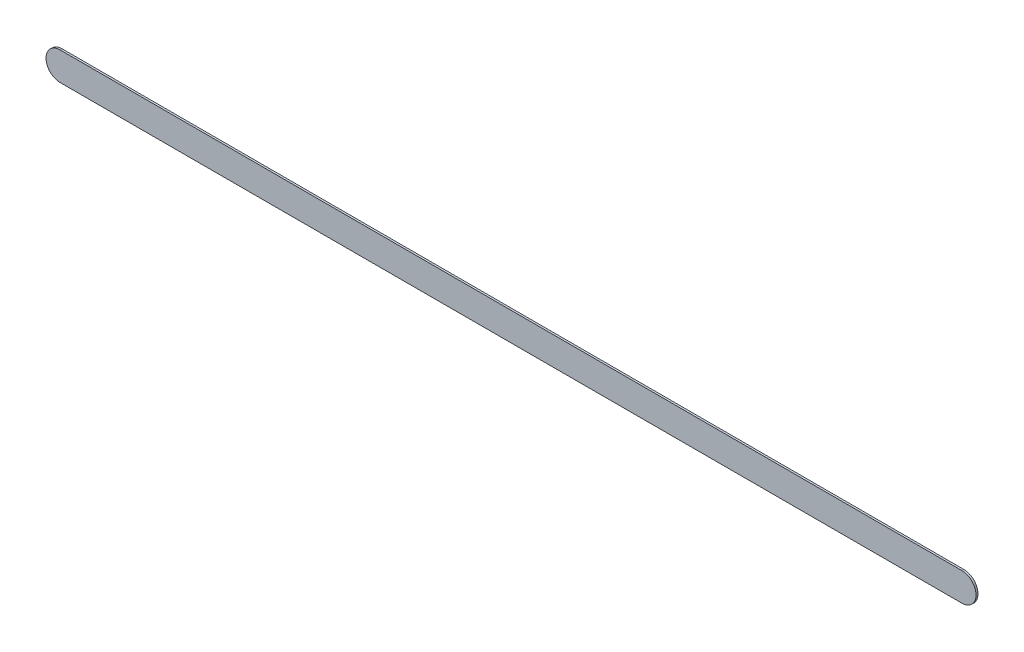
ISO-10303-21;
HEADER;
FILE_DESCRIPTION(('STEP AP214'),'2;1');
FILE_NAME('part.step','',(''),(''),'','','');
FILE_SCHEMA(('AUTOMOTIVE_DESIGN { 1 0 10303 214 1 1 1 1 }'));
ENDSEC;
DATA;
#1=APPLICATION_CONTEXT('core data for automotive mechanical design processes');
#2=APPLICATION_PROTOCOL_DEFINITION('international standard','automotive_design',2000,#1);
#3=PRODUCT_CONTEXT('',#1,'mechanical');
#4=PRODUCT('Part','Part','',(#3));
#5=PRODUCT_RELATED_PRODUCT_CATEGORY('part','',(#4));
#6=PRODUCT_DEFINITION_FORMATION('','',#4);
#7=PRODUCT_DEFINITION_CONTEXT('part definition',#1,'design');
#8=PRODUCT_DEFINITION('design','',#6,#7);
#9=PRODUCT_DEFINITION_SHAPE('','',#8);
#10=(LENGTH_UNIT() NAMED_UNIT(*) SI_UNIT(.MILLI.,.METRE.));
#11=(NAMED_UNIT(*) PLANE_ANGLE_UNIT() SI_UNIT($,.RADIAN.));
#12=(NAMED_UNIT(*) SI_UNIT($,.STERADIAN.) SOLID_ANGLE_UNIT());
#13=UNCERTAINTY_MEASURE_WITH_UNIT(LENGTH_MEASURE(1.E-05),#10,'distance_accuracy_value','');
#14=(GEOMETRIC_REPRESENTATION_CONTEXT(3) GLOBAL_UNCERTAINTY_ASSIGNED_CONTEXT((#13)) GLOBAL_UNIT_ASSIGNED_CONTEXT((#10,
#11,#12)) REPRESENTATION_CONTEXT('',''));
#15=CARTESIAN_POINT('',(0.,0.,0.));
#16=DIRECTION('',(0.,0.,1.));
#17=DIRECTION('',(1.,0.,0.));
#18=AXIS2_PLACEMENT_3D('',#15,#16,#17);
#19=CARTESIAN_POINT('',(144.9832,-75.95,0.));
#20=DIRECTION('',(0.,0.,1.));
#21=DIRECTION('',(1.,0.,0.));
#22=AXIS2_PLACEMENT_3D('',#19,#20,#21);
#23=PLANE('',#22);
#24=DIRECTION('',(-1.,0.,0.));
#25=VECTOR('',#24,1.);
#26=CARTESIAN_POINT('',(144.9832,-75.95,0.));
#27=LINE('',#26,#25);
#28=CARTESIAN_POINT('',(144.9832,-75.95,0.));
#29=VERTEX_POINT('',#28);
#30=CARTESIAN_POINT('',(129.032,-75.95,0.));
#31=VERTEX_POINT('',#30);
#32=EDGE_CURVE('E83',#29,#31,#27,.T.);
#33=ORIENTED_EDGE('',*,*,#32,.T.);
#34=CARTESIAN_POINT('',(129.032,-76.2,0.));
#35=DIRECTION('',(0.,0.,1.));
#36=DIRECTION('',(0.,1.,0.));
#37=AXIS2_PLACEMENT_3D('',#34,#35,#36);
#38=CIRCLE('',#37,0.25);
#39=CARTESIAN_POINT('',(129.032,-76.45,0.));
#40=VERTEX_POINT('',#39);
#41=EDGE_CURVE('E106',#31,#40,#38,.T.);
#42=ORIENTED_EDGE('',*,*,#41,.T.);
#43=DIRECTION('',(1.,0.,0.));
#44=VECTOR('',#43,1.);
#45=CARTESIAN_POINT('',(129.032,-76.45,0.));
#46=LINE('',#45,#44);
#47=CARTESIAN_POINT('',(144.9832,-76.45,0.));
#48=VERTEX_POINT('',#47);
#49=EDGE_CURVE('E76',#40,#48,#46,.T.);
#50=ORIENTED_EDGE('',*,*,#49,.T.);
#51=CARTESIAN_POINT('',(144.9832,-76.2,0.));
#52=DIRECTION('',(0.,0.,1.));
#53=DIRECTION('',(0.,-1.,0.));
#54=AXIS2_PLACEMENT_3D('',#51,#52,#53);
#55=CIRCLE('',#54,0.25);
#56=EDGE_CURVE('E11',#48,#29,#55,.T.);
#57=ORIENTED_EDGE('',*,*,#56,.T.);
#58=EDGE_LOOP('',(#33,#42,#50,#57));
#59=FACE_BOUND('',#58,.T.);
#60=ADVANCED_FACE('F17',(#59),#23,.T.);
#61=CARTESIAN_POINT('',(144.9832,-75.95,-0.035));
#62=DIRECTION('',(0.,0.,1.));
#63=DIRECTION('',(1.,0.,0.));
#64=AXIS2_PLACEMENT_3D('',#61,#62,#63);
#65=PLANE('',#64);
#66=CARTESIAN_POINT('',(144.9832,-76.2,-0.035));
#67=DIRECTION('',(0.,0.,1.));
#68=DIRECTION('',(0.,-1.,0.));
#69=AXIS2_PLACEMENT_3D('',#66,#67,#68);
#70=CIRCLE('',#69,0.25);
#71=CARTESIAN_POINT('',(144.9832,-76.45,-0.035));
#72=VERTEX_POINT('',#71);
#73=CARTESIAN_POINT('',(144.9832,-75.95,-0.035));
#74=VERTEX_POINT('',#73);
#75=EDGE_CURVE('E21',#72,#74,#70,.T.);
#76=ORIENTED_EDGE('',*,*,#75,.F.);
#77=DIRECTION('',(1.,0.,0.));
#78=VECTOR('',#77,1.);
#79=CARTESIAN_POINT('',(129.032,-76.45,-0.035));
#80=LINE('',#79,#78);
#81=CARTESIAN_POINT('',(129.032,-76.45,-0.035));
#82=VERTEX_POINT('',#81);
#83=EDGE_CURVE('E110',#82,#72,#80,.T.);
#84=ORIENTED_EDGE('',*,*,#83,.F.);
#85=CARTESIAN_POINT('',(129.032,-76.2,-0.035));
#86=DIRECTION('',(0.,0.,1.));
#87=DIRECTION('',(0.,1.,0.));
#88=AXIS2_PLACEMENT_3D('',#85,#86,#87);
#89=CIRCLE('',#88,0.25);
#90=CARTESIAN_POINT('',(129.032,-75.95,-0.035));
#91=VERTEX_POINT('',#90);
#92=EDGE_CURVE('E85',#91,#82,#89,.T.);
#93=ORIENTED_EDGE('',*,*,#92,.F.);
#94=DIRECTION('',(-1.,0.,0.));
#95=VECTOR('',#94,1.);
#96=CARTESIAN_POINT('',(144.9832,-75.95,-0.035));
#97=LINE('',#96,#95);
#98=EDGE_CURVE('E81',#74,#91,#97,.T.);
#99=ORIENTED_EDGE('',*,*,#98,.F.);
#100=EDGE_LOOP('',(#76,#84,#93,#99));
#101=FACE_BOUND('',#100,.T.);
#102=ADVANCED_FACE('F19',(#101),#65,.F.);
#103=CARTESIAN_POINT('',(144.9832,-76.2,-0.035));
#104=DIRECTION('',(0.,0.,-1.));
#105=DIRECTION('',(0.,-1.,0.));
#106=AXIS2_PLACEMENT_3D('',#103,#104,#105);
#107=CYLINDRICAL_SURFACE('',#106,0.25);
#108=ORIENTED_EDGE('',*,*,#75,.T.);
#109=DIRECTION('',(0.,0.,1.));
#110=VECTOR('',#109,1.);
#111=CARTESIAN_POINT('',(144.9832,-75.95,-0.035));
#112=LINE('',#111,#110);
#113=EDGE_CURVE('E70',#74,#29,#112,.T.);
#114=ORIENTED_EDGE('',*,*,#113,.T.);
#115=ORIENTED_EDGE('',*,*,#56,.F.);
#116=DIRECTION('',(0.,0.,1.));
#117=VECTOR('',#116,1.);
#118=CARTESIAN_POINT('',(144.9832,-76.45,-0.035));
#119=LINE('',#118,#117);
#120=EDGE_CURVE('E73',#72,#48,#119,.T.);
#121=ORIENTED_EDGE('',*,*,#120,.F.);
#122=EDGE_LOOP('',(#108,#114,#115,#121));
#123=FACE_BOUND('',#122,.T.);
#124=ADVANCED_FACE('F69',(#123),#107,.T.);
#125=CARTESIAN_POINT('',(129.032,-76.45,-0.035));
#126=DIRECTION('',(0.,1.,0.));
#127=DIRECTION('',(1.,0.,0.));
#128=AXIS2_PLACEMENT_3D('',#125,#126,#127);
#129=PLANE('',#128);
#130=ORIENTED_EDGE('',*,*,#83,.T.);
#131=ORIENTED_EDGE('',*,*,#120,.T.);
#132=ORIENTED_EDGE('',*,*,#49,.F.);
#133=DIRECTION('',(0.,0.,1.));
#134=VECTOR('',#133,1.);
#135=CARTESIAN_POINT('',(129.032,-76.45,-0.035));
#136=LINE('',#135,#134);
#137=EDGE_CURVE('E100',#82,#40,#136,.T.);
#138=ORIENTED_EDGE('',*,*,#137,.F.);
#139=EDGE_LOOP('',(#130,#131,#132,#138));
#140=FACE_BOUND('',#139,.T.);
#141=ADVANCED_FACE('F120',(#140),#129,.F.);
#142=CARTESIAN_POINT('',(129.032,-76.2,-0.035));
#143=DIRECTION('',(0.,0.,-1.));
#144=DIRECTION('',(0.,1.,0.));
#145=AXIS2_PLACEMENT_3D('',#142,#143,#144);
#146=CYLINDRICAL_SURFACE('',#145,0.25);
#147=ORIENTED_EDGE('',*,*,#92,.T.);
#148=ORIENTED_EDGE('',*,*,#137,.T.);
#149=ORIENTED_EDGE('',*,*,#41,.F.);
#150=DIRECTION('',(0.,0.,1.));
#151=VECTOR('',#150,1.);
#152=CARTESIAN_POINT('',(129.032,-75.95,-0.035));
#153=LINE('',#152,#151);
#154=EDGE_CURVE('E90',#91,#31,#153,.T.);
#155=ORIENTED_EDGE('',*,*,#154,.F.);
#156=EDGE_LOOP('',(#147,#148,#149,#155));
#157=FACE_BOUND('',#156,.T.);
#158=ADVANCED_FACE('F122',(#157),#146,.T.);
#159=CARTESIAN_POINT('',(144.9832,-75.95,-0.035));
#160=DIRECTION('',(0.,-1.,0.));
#161=DIRECTION('',(0.,0.,-1.));
#162=AXIS2_PLACEMENT_3D('',#159,#160,#161);
#163=PLANE('',#162);
#164=ORIENTED_EDGE('',*,*,#98,.T.);
#165=ORIENTED_EDGE('',*,*,#154,.T.);
#166=ORIENTED_EDGE('',*,*,#32,.F.);
#167=ORIENTED_EDGE('',*,*,#113,.F.);
#168=EDGE_LOOP('',(#164,#165,#166,#167));
#169=FACE_BOUND('',#168,.T.);
#170=ADVANCED_FACE('F79',(#169),#163,.F.);
#171=CLOSED_SHELL('',(#60,#102,#124,#141,#158,#170));
#172=MANIFOLD_SOLID_BREP('B1',#171);
#173=ADVANCED_BREP_SHAPE_REPRESENTATION('',(#18,#172),#14);
#174=SHAPE_DEFINITION_REPRESENTATION(#9,#173);
ENDSEC;
END-ISO-10303-21;
